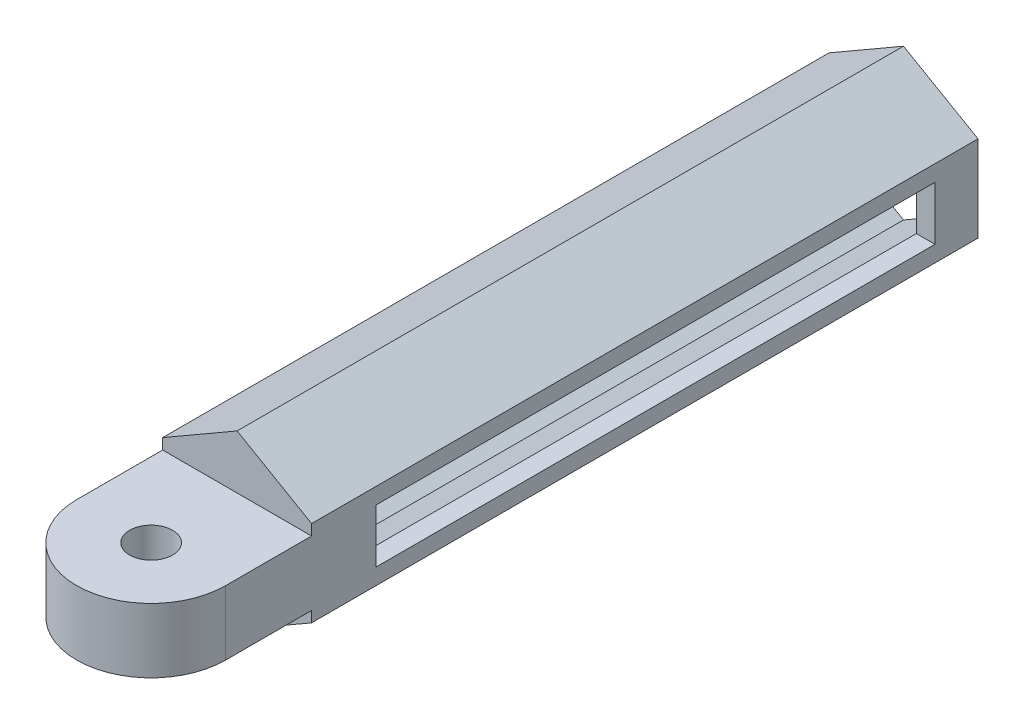
ISO-10303-21;
HEADER;
FILE_DESCRIPTION(('STEP AP214'),'2;1');
FILE_NAME('part.step','',(''),(''),'','','');
FILE_SCHEMA(('AUTOMOTIVE_DESIGN { 1 0 10303 214 1 1 1 1 }'));
ENDSEC;
DATA;
#1=APPLICATION_CONTEXT('core data for automotive mechanical design processes');
#2=APPLICATION_PROTOCOL_DEFINITION('international standard','automotive_design',2000,#1);
#3=PRODUCT_CONTEXT('',#1,'mechanical');
#4=PRODUCT('Part','Part','',(#3));
#5=PRODUCT_RELATED_PRODUCT_CATEGORY('part','',(#4));
#6=PRODUCT_DEFINITION_FORMATION('','',#4);
#7=PRODUCT_DEFINITION_CONTEXT('part definition',#1,'design');
#8=PRODUCT_DEFINITION('design','',#6,#7);
#9=PRODUCT_DEFINITION_SHAPE('','',#8);
#10=(LENGTH_UNIT() NAMED_UNIT(*) SI_UNIT(.MILLI.,.METRE.));
#11=(NAMED_UNIT(*) PLANE_ANGLE_UNIT() SI_UNIT($,.RADIAN.));
#12=(NAMED_UNIT(*) SI_UNIT($,.STERADIAN.) SOLID_ANGLE_UNIT());
#13=UNCERTAINTY_MEASURE_WITH_UNIT(LENGTH_MEASURE(1.E-05),#10,'distance_accuracy_value','');
#14=(GEOMETRIC_REPRESENTATION_CONTEXT(3) GLOBAL_UNCERTAINTY_ASSIGNED_CONTEXT((#13)) GLOBAL_UNIT_ASSIGNED_CONTEXT((#10,
#11,#12)) REPRESENTATION_CONTEXT('',''));
#15=CARTESIAN_POINT('',(0.,0.,0.));
#16=DIRECTION('',(0.,0.,1.));
#17=DIRECTION('',(1.,0.,0.));
#18=AXIS2_PLACEMENT_3D('',#15,#16,#17);
#19=CARTESIAN_POINT('',(0.,0.,31.));
#20=DIRECTION('',(0.,0.,1.));
#21=DIRECTION('',(1.,0.,0.));
#22=AXIS2_PLACEMENT_3D('',#19,#20,#21);
#23=PLANE('',#22);
#24=DIRECTION('',(0.,1.,0.));
#25=VECTOR('',#24,1.);
#26=CARTESIAN_POINT('',(3.46410161513775,-2.,31.));
#27=LINE('',#26,#25);
#28=CARTESIAN_POINT('',(3.46410161513775,-2.,31.));
#29=VERTEX_POINT('',#28);
#30=CARTESIAN_POINT('',(3.46410161513775,-1.5,31.));
#31=VERTEX_POINT('',#30);
#32=EDGE_CURVE('E222',#29,#31,#27,.T.);
#33=ORIENTED_EDGE('',*,*,#32,.T.);
#34=DIRECTION('',(-1.,0.,0.));
#35=VECTOR('',#34,1.);
#36=CARTESIAN_POINT('',(3.46410161513775,-1.5,31.));
#37=LINE('',#36,#35);
#38=CARTESIAN_POINT('',(-3.46410161513775,-1.5,31.));
#39=VERTEX_POINT('',#38);
#40=EDGE_CURVE('E404',#31,#39,#37,.T.);
#41=ORIENTED_EDGE('',*,*,#40,.T.);
#42=DIRECTION('',(0.,-1.,0.));
#43=VECTOR('',#42,1.);
#44=CARTESIAN_POINT('',(-3.46410161513775,2.,31.));
#45=LINE('',#44,#43);
#46=CARTESIAN_POINT('',(-3.46410161513775,-2.,31.));
#47=VERTEX_POINT('',#46);
#48=EDGE_CURVE('E370',#39,#47,#45,.T.);
#49=ORIENTED_EDGE('',*,*,#48,.T.);
#50=DIRECTION('',(0.866025403784439,-0.5,0.));
#51=VECTOR('',#50,1.);
#52=CARTESIAN_POINT('',(-3.46410161513775,-2.,31.));
#53=LINE('',#52,#51);
#54=CARTESIAN_POINT('',(0.,-4.,31.));
#55=VERTEX_POINT('',#54);
#56=EDGE_CURVE('E228',#47,#55,#53,.T.);
#57=ORIENTED_EDGE('',*,*,#56,.T.);
#58=DIRECTION('',(0.866025403784438,0.5,0.));
#59=VECTOR('',#58,1.);
#60=CARTESIAN_POINT('',(0.,-4.,31.));
#61=LINE('',#60,#59);
#62=EDGE_CURVE('E223',#55,#29,#61,.T.);
#63=ORIENTED_EDGE('',*,*,#62,.T.);
#64=EDGE_LOOP('',(#33,#41,#49,#57,#63));
#65=FACE_BOUND('',#64,.T.);
#66=ADVANCED_FACE('F33',(#65),#23,.T.);
#67=CARTESIAN_POINT('',(0.,0.,0.));
#68=DIRECTION('',(0.,0.,1.));
#69=DIRECTION('',(1.,0.,0.));
#70=AXIS2_PLACEMENT_3D('',#67,#68,#69);
#71=PLANE('',#70);
#72=DIRECTION('',(-0.866025403784439,0.5,0.));
#73=VECTOR('',#72,1.);
#74=CARTESIAN_POINT('',(3.46410161513775,2.,0.));
#75=LINE('',#74,#73);
#76=CARTESIAN_POINT('',(3.46410161513775,2.,0.));
#77=VERTEX_POINT('',#76);
#78=CARTESIAN_POINT('',(0.,4.,0.));
#79=VERTEX_POINT('',#78);
#80=EDGE_CURVE('E281',#77,#79,#75,.T.);
#81=ORIENTED_EDGE('',*,*,#80,.F.);
#82=DIRECTION('',(0.,1.,0.));
#83=VECTOR('',#82,1.);
#84=CARTESIAN_POINT('',(3.46410161513776,-2.,0.));
#85=LINE('',#84,#83);
#86=CARTESIAN_POINT('',(3.46410161513776,-2.,0.));
#87=VERTEX_POINT('',#86);
#88=EDGE_CURVE('E292',#87,#77,#85,.T.);
#89=ORIENTED_EDGE('',*,*,#88,.F.);
#90=DIRECTION('',(0.866025403784439,0.5,0.));
#91=VECTOR('',#90,1.);
#92=CARTESIAN_POINT('',(0.,-4.,0.));
#93=LINE('',#92,#91);
#94=CARTESIAN_POINT('',(0.,-4.,0.));
#95=VERTEX_POINT('',#94);
#96=EDGE_CURVE('E290',#95,#87,#93,.T.);
#97=ORIENTED_EDGE('',*,*,#96,.F.);
#98=DIRECTION('',(0.866025403784439,-0.5,0.));
#99=VECTOR('',#98,1.);
#100=CARTESIAN_POINT('',(-3.46410161513775,-2.,0.));
#101=LINE('',#100,#99);
#102=CARTESIAN_POINT('',(-3.46410161513775,-2.,0.));
#103=VERTEX_POINT('',#102);
#104=EDGE_CURVE('E288',#103,#95,#101,.T.);
#105=ORIENTED_EDGE('',*,*,#104,.F.);
#106=DIRECTION('',(0.,-1.,0.));
#107=VECTOR('',#106,1.);
#108=CARTESIAN_POINT('',(-3.46410161513775,2.,0.));
#109=LINE('',#108,#107);
#110=CARTESIAN_POINT('',(-3.46410161513775,2.,0.));
#111=VERTEX_POINT('',#110);
#112=EDGE_CURVE('E286',#111,#103,#109,.T.);
#113=ORIENTED_EDGE('',*,*,#112,.F.);
#114=DIRECTION('',(-0.866025403784439,-0.5,0.));
#115=VECTOR('',#114,1.);
#116=CARTESIAN_POINT('',(0.,4.,0.));
#117=LINE('',#116,#115);
#118=EDGE_CURVE('E284',#79,#111,#117,.T.);
#119=ORIENTED_EDGE('',*,*,#118,.F.);
#120=EDGE_LOOP('',(#81,#89,#97,#105,#113,#119));
#121=FACE_BOUND('',#120,.T.);
#122=DIRECTION('',(-0.866025403784439,0.5,0.));
#123=VECTOR('',#122,1.);
#124=CARTESIAN_POINT('',(2.59807621135332,1.5,0.));
#125=LINE('',#124,#123);
#126=CARTESIAN_POINT('',(2.59807621135332,1.5,0.));
#127=VERTEX_POINT('',#126);
#128=CARTESIAN_POINT('',(0.,3.,0.));
#129=VERTEX_POINT('',#128);
#130=EDGE_CURVE('E226',#127,#129,#125,.T.);
#131=ORIENTED_EDGE('',*,*,#130,.T.);
#132=DIRECTION('',(-0.866025403784439,-0.5,0.));
#133=VECTOR('',#132,1.);
#134=CARTESIAN_POINT('',(0.,3.,0.));
#135=LINE('',#134,#133);
#136=CARTESIAN_POINT('',(-2.59807621135332,1.5,0.));
#137=VERTEX_POINT('',#136);
#138=EDGE_CURVE('E254',#129,#137,#135,.T.);
#139=ORIENTED_EDGE('',*,*,#138,.T.);
#140=DIRECTION('',(0.,-1.,0.));
#141=VECTOR('',#140,1.);
#142=CARTESIAN_POINT('',(-2.59807621135332,1.5,0.));
#143=LINE('',#142,#141);
#144=CARTESIAN_POINT('',(-2.59807621135332,-1.5,0.));
#145=VERTEX_POINT('',#144);
#146=EDGE_CURVE('E257',#137,#145,#143,.T.);
#147=ORIENTED_EDGE('',*,*,#146,.T.);
#148=DIRECTION('',(0.866025403784439,-0.5,0.));
#149=VECTOR('',#148,1.);
#150=CARTESIAN_POINT('',(-2.59807621135332,-1.5,0.));
#151=LINE('',#150,#149);
#152=CARTESIAN_POINT('',(0.,-3.,0.));
#153=VERTEX_POINT('',#152);
#154=EDGE_CURVE('E260',#145,#153,#151,.T.);
#155=ORIENTED_EDGE('',*,*,#154,.T.);
#156=DIRECTION('',(0.866025403784439,0.5,0.));
#157=VECTOR('',#156,1.);
#158=CARTESIAN_POINT('',(0.,-3.,0.));
#159=LINE('',#158,#157);
#160=CARTESIAN_POINT('',(2.59807621135332,-1.5,0.));
#161=VERTEX_POINT('',#160);
#162=EDGE_CURVE('E263',#153,#161,#159,.T.);
#163=ORIENTED_EDGE('',*,*,#162,.T.);
#164=DIRECTION('',(0.,1.,0.));
#165=VECTOR('',#164,1.);
#166=CARTESIAN_POINT('',(2.59807621135332,-1.5,0.));
#167=LINE('',#166,#165);
#168=EDGE_CURVE('E236',#161,#127,#167,.T.);
#169=ORIENTED_EDGE('',*,*,#168,.T.);
#170=EDGE_LOOP('',(#131,#139,#147,#155,#163,#169));
#171=FACE_BOUND('',#170,.T.);
#172=ADVANCED_FACE('F386',(#121,#171),#71,.F.);
#173=CARTESIAN_POINT('',(3.46410161513775,2.,30.));
#174=DIRECTION('',(-0.5,-0.866025403784439,0.));
#175=DIRECTION('',(0.866025403784439,-0.5,0.));
#176=AXIS2_PLACEMENT_3D('',#173,#174,#175);
#177=PLANE('',#176);
#178=ORIENTED_EDGE('',*,*,#80,.T.);
#179=DIRECTION('',(0.,0.,-1.));
#180=VECTOR('',#179,1.);
#181=CARTESIAN_POINT('',(0.,4.,30.));
#182=LINE('',#181,#180);
#183=CARTESIAN_POINT('',(0.,4.,31.));
#184=VERTEX_POINT('',#183);
#185=EDGE_CURVE('E307',#184,#79,#182,.T.);
#186=ORIENTED_EDGE('',*,*,#185,.F.);
#187=DIRECTION('',(-0.866025403784439,0.5,0.));
#188=VECTOR('',#187,1.);
#189=CARTESIAN_POINT('',(3.46410161513775,2.,31.));
#190=LINE('',#189,#188);
#191=CARTESIAN_POINT('',(3.46410161513775,2.,31.));
#192=VERTEX_POINT('',#191);
#193=EDGE_CURVE('E366',#192,#184,#190,.T.);
#194=ORIENTED_EDGE('',*,*,#193,.F.);
#195=DIRECTION('',(0.,0.,-1.));
#196=VECTOR('',#195,1.);
#197=CARTESIAN_POINT('',(3.46410161513775,2.,30.));
#198=LINE('',#197,#196);
#199=EDGE_CURVE('E220',#192,#77,#198,.T.);
#200=ORIENTED_EDGE('',*,*,#199,.T.);
#201=EDGE_LOOP('',(#178,#186,#194,#200));
#202=FACE_BOUND('',#201,.T.);
#203=ADVANCED_FACE('F35',(#202),#177,.F.);
#204=CARTESIAN_POINT('',(0.,4.,30.));
#205=DIRECTION('',(0.5,-0.866025403784439,0.));
#206=DIRECTION('',(0.866025403784439,0.5,0.));
#207=AXIS2_PLACEMENT_3D('',#204,#205,#206);
#208=PLANE('',#207);
#209=ORIENTED_EDGE('',*,*,#118,.T.);
#210=DIRECTION('',(0.,0.,-1.));
#211=VECTOR('',#210,1.);
#212=CARTESIAN_POINT('',(-3.46410161513775,2.,30.));
#213=LINE('',#212,#211);
#214=CARTESIAN_POINT('',(-3.46410161513775,2.,31.));
#215=VERTEX_POINT('',#214);
#216=EDGE_CURVE('E304',#215,#111,#213,.T.);
#217=ORIENTED_EDGE('',*,*,#216,.F.);
#218=DIRECTION('',(-0.866025403784439,-0.5,0.));
#219=VECTOR('',#218,1.);
#220=CARTESIAN_POINT('',(0.,4.,31.));
#221=LINE('',#220,#219);
#222=EDGE_CURVE('E368',#184,#215,#221,.T.);
#223=ORIENTED_EDGE('',*,*,#222,.F.);
#224=ORIENTED_EDGE('',*,*,#185,.T.);
#225=EDGE_LOOP('',(#209,#217,#223,#224));
#226=FACE_BOUND('',#225,.T.);
#227=ADVANCED_FACE('F586',(#226),#208,.F.);
#228=CARTESIAN_POINT('',(-3.46410161513775,2.,30.));
#229=DIRECTION('',(1.,0.,0.));
#230=DIRECTION('',(0.,0.,-1.));
#231=AXIS2_PLACEMENT_3D('',#228,#229,#230);
#232=PLANE('',#231);
#233=DIRECTION('',(0.,0.,-1.));
#234=VECTOR('',#233,1.);
#235=CARTESIAN_POINT('',(-3.46410161513775,1.25,28.));
#236=LINE('',#235,#234);
#237=CARTESIAN_POINT('',(-3.46410161513775,1.25,28.));
#238=VERTEX_POINT('',#237);
#239=CARTESIAN_POINT('',(-3.46410161513775,1.25,2.));
#240=VERTEX_POINT('',#239);
#241=EDGE_CURVE('E415',#238,#240,#236,.T.);
#242=ORIENTED_EDGE('',*,*,#241,.F.);
#243=DIRECTION('',(0.,1.,0.));
#244=VECTOR('',#243,1.);
#245=CARTESIAN_POINT('',(-3.46410161513775,1.25,28.));
#246=LINE('',#245,#244);
#247=CARTESIAN_POINT('',(-3.46410161513775,-1.25,28.));
#248=VERTEX_POINT('',#247);
#249=EDGE_CURVE('E357',#248,#238,#246,.T.);
#250=ORIENTED_EDGE('',*,*,#249,.F.);
#251=DIRECTION('',(0.,0.,1.));
#252=VECTOR('',#251,1.);
#253=CARTESIAN_POINT('',(-3.46410161513775,-1.25,28.));
#254=LINE('',#253,#252);
#255=CARTESIAN_POINT('',(-3.46410161513775,-1.25,2.));
#256=VERTEX_POINT('',#255);
#257=EDGE_CURVE('E354',#256,#248,#254,.T.);
#258=ORIENTED_EDGE('',*,*,#257,.F.);
#259=DIRECTION('',(0.,-1.,0.));
#260=VECTOR('',#259,1.);
#261=CARTESIAN_POINT('',(-3.46410161513775,1.25,2.));
#262=LINE('',#261,#260);
#263=EDGE_CURVE('E413',#240,#256,#262,.T.);
#264=ORIENTED_EDGE('',*,*,#263,.F.);
#265=EDGE_LOOP('',(#242,#250,#258,#264));
#266=FACE_BOUND('',#265,.T.);
#267=ORIENTED_EDGE('',*,*,#112,.T.);
#268=DIRECTION('',(0.,0.,-1.));
#269=VECTOR('',#268,1.);
#270=CARTESIAN_POINT('',(-3.46410161513775,-2.,30.));
#271=LINE('',#270,#269);
#272=EDGE_CURVE('E301',#47,#103,#271,.T.);
#273=ORIENTED_EDGE('',*,*,#272,.F.);
#274=ORIENTED_EDGE('',*,*,#48,.F.);
#275=DIRECTION('',(0.,0.,1.));
#276=VECTOR('',#275,1.);
#277=CARTESIAN_POINT('',(-3.46410161513775,-1.5,31.));
#278=LINE('',#277,#276);
#279=CARTESIAN_POINT('',(-3.46410161513775,-1.5,35.));
#280=VERTEX_POINT('',#279);
#281=EDGE_CURVE('E48',#39,#280,#278,.T.);
#282=ORIENTED_EDGE('',*,*,#281,.T.);
#283=DIRECTION('',(0.,1.,0.));
#284=VECTOR('',#283,1.);
#285=CARTESIAN_POINT('',(-3.46410161513775,-1.5,35.));
#286=LINE('',#285,#284);
#287=CARTESIAN_POINT('',(-3.46410161513775,1.5,35.));
#288=VERTEX_POINT('',#287);
#289=EDGE_CURVE('E395',#280,#288,#286,.T.);
#290=ORIENTED_EDGE('',*,*,#289,.T.);
#291=DIRECTION('',(0.,0.,1.));
#292=VECTOR('',#291,1.);
#293=CARTESIAN_POINT('',(-3.46410161513775,1.5,31.));
#294=LINE('',#293,#292);
#295=CARTESIAN_POINT('',(-3.46410161513775,1.5,31.));
#296=VERTEX_POINT('',#295);
#297=EDGE_CURVE('E216',#296,#288,#294,.T.);
#298=ORIENTED_EDGE('',*,*,#297,.F.);
#299=EDGE_CURVE('E215',#215,#296,#45,.T.);
#300=ORIENTED_EDGE('',*,*,#299,.F.);
#301=ORIENTED_EDGE('',*,*,#216,.T.);
#302=EDGE_LOOP('',(#267,#273,#274,#282,#290,#298,#300,#301));
#303=FACE_BOUND('',#302,.T.);
#304=ADVANCED_FACE('F394',(#266,#303),#232,.F.);
#305=CARTESIAN_POINT('',(-3.46410161513775,-2.,30.));
#306=DIRECTION('',(0.5,0.866025403784439,0.));
#307=DIRECTION('',(-0.866025403784439,0.5,0.));
#308=AXIS2_PLACEMENT_3D('',#305,#306,#307);
#309=PLANE('',#308);
#310=ORIENTED_EDGE('',*,*,#104,.T.);
#311=DIRECTION('',(0.,0.,-1.));
#312=VECTOR('',#311,1.);
#313=CARTESIAN_POINT('',(0.,-4.,30.));
#314=LINE('',#313,#312);
#315=EDGE_CURVE('E298',#55,#95,#314,.T.);
#316=ORIENTED_EDGE('',*,*,#315,.F.);
#317=ORIENTED_EDGE('',*,*,#56,.F.);
#318=ORIENTED_EDGE('',*,*,#272,.T.);
#319=EDGE_LOOP('',(#310,#316,#317,#318));
#320=FACE_BOUND('',#319,.T.);
#321=ADVANCED_FACE('F439',(#320),#309,.F.);
#322=CARTESIAN_POINT('',(0.,-4.,30.));
#323=DIRECTION('',(-0.5,0.866025403784439,0.));
#324=DIRECTION('',(-0.866025403784439,-0.5,0.));
#325=AXIS2_PLACEMENT_3D('',#322,#323,#324);
#326=PLANE('',#325);
#327=ORIENTED_EDGE('',*,*,#96,.T.);
#328=DIRECTION('',(0.,0.,-1.));
#329=VECTOR('',#328,1.);
#330=CARTESIAN_POINT('',(3.46410161513776,-2.,30.));
#331=LINE('',#330,#329);
#332=EDGE_CURVE('E295',#29,#87,#331,.T.);
#333=ORIENTED_EDGE('',*,*,#332,.F.);
#334=ORIENTED_EDGE('',*,*,#62,.F.);
#335=ORIENTED_EDGE('',*,*,#315,.T.);
#336=EDGE_LOOP('',(#327,#333,#334,#335));
#337=FACE_BOUND('',#336,.T.);
#338=ADVANCED_FACE('F380',(#337),#326,.F.);
#339=CARTESIAN_POINT('',(3.46410161513776,-2.,30.));
#340=DIRECTION('',(-1.,0.,0.));
#341=DIRECTION('',(0.,-1.,0.));
#342=AXIS2_PLACEMENT_3D('',#339,#340,#341);
#343=PLANE('',#342);
#344=DIRECTION('',(0.,0.,-1.));
#345=VECTOR('',#344,1.);
#346=CARTESIAN_POINT('',(3.46410161513775,-1.25,28.));
#347=LINE('',#346,#345);
#348=CARTESIAN_POINT('',(3.46410161513775,-1.25,28.));
#349=VERTEX_POINT('',#348);
#350=CARTESIAN_POINT('',(3.46410161513775,-1.25,2.));
#351=VERTEX_POINT('',#350);
#352=EDGE_CURVE('E420',#349,#351,#347,.T.);
#353=ORIENTED_EDGE('',*,*,#352,.F.);
#354=DIRECTION('',(0.,-1.,0.));
#355=VECTOR('',#354,1.);
#356=CARTESIAN_POINT('',(3.46410161513775,1.25,28.));
#357=LINE('',#356,#355);
#358=CARTESIAN_POINT('',(3.46410161513775,1.25,28.));
#359=VERTEX_POINT('',#358);
#360=EDGE_CURVE('E347',#359,#349,#357,.T.);
#361=ORIENTED_EDGE('',*,*,#360,.F.);
#362=DIRECTION('',(0.,0.,1.));
#363=VECTOR('',#362,1.);
#364=CARTESIAN_POINT('',(3.46410161513775,1.25,28.));
#365=LINE('',#364,#363);
#366=CARTESIAN_POINT('',(3.46410161513775,1.25,2.));
#367=VERTEX_POINT('',#366);
#368=EDGE_CURVE('E349',#367,#359,#365,.T.);
#369=ORIENTED_EDGE('',*,*,#368,.F.);
#370=DIRECTION('',(0.,1.,0.));
#371=VECTOR('',#370,1.);
#372=CARTESIAN_POINT('',(3.46410161513775,1.25,2.));
#373=LINE('',#372,#371);
#374=EDGE_CURVE('E330',#351,#367,#373,.T.);
#375=ORIENTED_EDGE('',*,*,#374,.F.);
#376=EDGE_LOOP('',(#353,#361,#369,#375));
#377=FACE_BOUND('',#376,.T.);
#378=ORIENTED_EDGE('',*,*,#88,.T.);
#379=ORIENTED_EDGE('',*,*,#199,.F.);
#380=CARTESIAN_POINT('',(3.46410161513775,1.5,31.));
#381=VERTEX_POINT('',#380);
#382=EDGE_CURVE('E211',#381,#192,#27,.T.);
#383=ORIENTED_EDGE('',*,*,#382,.F.);
#384=DIRECTION('',(0.,0.,-1.));
#385=VECTOR('',#384,1.);
#386=CARTESIAN_POINT('',(3.46410161513775,1.5,31.));
#387=LINE('',#386,#385);
#388=CARTESIAN_POINT('',(3.46410161513775,1.5,35.));
#389=VERTEX_POINT('',#388);
#390=EDGE_CURVE('E194',#389,#381,#387,.T.);
#391=ORIENTED_EDGE('',*,*,#390,.F.);
#392=DIRECTION('',(0.,1.,0.));
#393=VECTOR('',#392,1.);
#394=CARTESIAN_POINT('',(3.46410161513775,-1.5,35.));
#395=LINE('',#394,#393);
#396=CARTESIAN_POINT('',(3.46410161513775,-1.5,35.));
#397=VERTEX_POINT('',#396);
#398=EDGE_CURVE('E410',#397,#389,#395,.T.);
#399=ORIENTED_EDGE('',*,*,#398,.F.);
#400=DIRECTION('',(0.,0.,-1.));
#401=VECTOR('',#400,1.);
#402=CARTESIAN_POINT('',(3.46410161513775,-1.5,31.));
#403=LINE('',#402,#401);
#404=EDGE_CURVE('E402',#397,#31,#403,.T.);
#405=ORIENTED_EDGE('',*,*,#404,.T.);
#406=ORIENTED_EDGE('',*,*,#32,.F.);
#407=ORIENTED_EDGE('',*,*,#332,.T.);
#408=EDGE_LOOP('',(#378,#379,#383,#391,#399,#405,#406,#407));
#409=FACE_BOUND('',#408,.T.);
#410=ADVANCED_FACE('F218',(#377,#409),#343,.F.);
#411=CARTESIAN_POINT('',(2.59807621135332,1.5,30.));
#412=DIRECTION('',(-0.5,-0.866025403784439,0.));
#413=DIRECTION('',(0.866025403784439,-0.5,0.));
#414=AXIS2_PLACEMENT_3D('',#411,#412,#413);
#415=PLANE('',#414);
#416=ORIENTED_EDGE('',*,*,#130,.F.);
#417=DIRECTION('',(0.,0.,-1.));
#418=VECTOR('',#417,1.);
#419=CARTESIAN_POINT('',(2.59807621135332,1.5,30.));
#420=LINE('',#419,#418);
#421=CARTESIAN_POINT('',(2.59807621135332,1.5,30.));
#422=VERTEX_POINT('',#421);
#423=EDGE_CURVE('E251',#422,#127,#420,.T.);
#424=ORIENTED_EDGE('',*,*,#423,.F.);
#425=DIRECTION('',(-0.866025403784439,0.5,0.));
#426=VECTOR('',#425,1.);
#427=CARTESIAN_POINT('',(2.59807621135332,1.5,30.));
#428=LINE('',#427,#426);
#429=CARTESIAN_POINT('',(0.,3.,30.));
#430=VERTEX_POINT('',#429);
#431=EDGE_CURVE('E232',#422,#430,#428,.T.);
#432=ORIENTED_EDGE('',*,*,#431,.T.);
#433=DIRECTION('',(0.,0.,-1.));
#434=VECTOR('',#433,1.);
#435=CARTESIAN_POINT('',(0.,3.,30.));
#436=LINE('',#435,#434);
#437=EDGE_CURVE('E278',#430,#129,#436,.T.);
#438=ORIENTED_EDGE('',*,*,#437,.T.);
#439=EDGE_LOOP('',(#416,#424,#432,#438));
#440=FACE_BOUND('',#439,.T.);
#441=ADVANCED_FACE('F430',(#440),#415,.T.);
#442=CARTESIAN_POINT('',(0.,3.,30.));
#443=DIRECTION('',(0.5,-0.866025403784439,0.));
#444=DIRECTION('',(0.866025403784439,0.5,0.));
#445=AXIS2_PLACEMENT_3D('',#442,#443,#444);
#446=PLANE('',#445);
#447=ORIENTED_EDGE('',*,*,#138,.F.);
#448=ORIENTED_EDGE('',*,*,#437,.F.);
#449=DIRECTION('',(-0.866025403784439,-0.5,0.));
#450=VECTOR('',#449,1.);
#451=CARTESIAN_POINT('',(0.,3.,30.));
#452=LINE('',#451,#450);
#453=CARTESIAN_POINT('',(-2.59807621135332,1.5,30.));
#454=VERTEX_POINT('',#453);
#455=EDGE_CURVE('E235',#430,#454,#452,.T.);
#456=ORIENTED_EDGE('',*,*,#455,.T.);
#457=DIRECTION('',(0.,0.,-1.));
#458=VECTOR('',#457,1.);
#459=CARTESIAN_POINT('',(-2.59807621135332,1.5,30.));
#460=LINE('',#459,#458);
#461=EDGE_CURVE('E276',#454,#137,#460,.T.);
#462=ORIENTED_EDGE('',*,*,#461,.T.);
#463=EDGE_LOOP('',(#447,#448,#456,#462));
#464=FACE_BOUND('',#463,.T.);
#465=ADVANCED_FACE('F436',(#464),#446,.T.);
#466=CARTESIAN_POINT('',(-2.59807621135332,1.5,30.));
#467=DIRECTION('',(1.,0.,0.));
#468=DIRECTION('',(0.,0.,-1.));
#469=AXIS2_PLACEMENT_3D('',#466,#467,#468);
#470=PLANE('',#469);
#471=DIRECTION('',(0.,-1.,0.));
#472=VECTOR('',#471,1.);
#473=CARTESIAN_POINT('',(-2.59807621135332,1.5,28.));
#474=LINE('',#473,#472);
#475=CARTESIAN_POINT('',(-2.59807621135331,1.25,28.));
#476=VERTEX_POINT('',#475);
#477=CARTESIAN_POINT('',(-2.59807621135332,-1.25,28.));
#478=VERTEX_POINT('',#477);
#479=EDGE_CURVE('E363',#476,#478,#474,.T.);
#480=ORIENTED_EDGE('',*,*,#479,.F.);
#481=DIRECTION('',(0.,0.,1.));
#482=VECTOR('',#481,1.);
#483=CARTESIAN_POINT('',(-2.59807621135332,1.25,30.));
#484=LINE('',#483,#482);
#485=CARTESIAN_POINT('',(-2.59807621135331,1.25,2.));
#486=VERTEX_POINT('',#485);
#487=EDGE_CURVE('E361',#486,#476,#484,.T.);
#488=ORIENTED_EDGE('',*,*,#487,.F.);
#489=DIRECTION('',(0.,1.,0.));
#490=VECTOR('',#489,1.);
#491=CARTESIAN_POINT('',(-2.59807621135332,1.5,2.));
#492=LINE('',#491,#490);
#493=CARTESIAN_POINT('',(-2.59807621135331,-1.25,2.));
#494=VERTEX_POINT('',#493);
#495=EDGE_CURVE('E359',#494,#486,#492,.T.);
#496=ORIENTED_EDGE('',*,*,#495,.F.);
#497=DIRECTION('',(0.,0.,-1.));
#498=VECTOR('',#497,1.);
#499=CARTESIAN_POINT('',(-2.59807621135332,-1.25,30.));
#500=LINE('',#499,#498);
#501=EDGE_CURVE('E356',#478,#494,#500,.T.);
#502=ORIENTED_EDGE('',*,*,#501,.F.);
#503=EDGE_LOOP('',(#480,#488,#496,#502));
#504=FACE_BOUND('',#503,.T.);
#505=ORIENTED_EDGE('',*,*,#146,.F.);
#506=ORIENTED_EDGE('',*,*,#461,.F.);
#507=DIRECTION('',(0.,-1.,0.));
#508=VECTOR('',#507,1.);
#509=CARTESIAN_POINT('',(-2.59807621135332,1.5,30.));
#510=LINE('',#509,#508);
#511=CARTESIAN_POINT('',(-2.59807621135332,-1.5,30.));
#512=VERTEX_POINT('',#511);
#513=EDGE_CURVE('E239',#454,#512,#510,.T.);
#514=ORIENTED_EDGE('',*,*,#513,.T.);
#515=DIRECTION('',(0.,0.,-1.));
#516=VECTOR('',#515,1.);
#517=CARTESIAN_POINT('',(-2.59807621135332,-1.5,30.));
#518=LINE('',#517,#516);
#519=EDGE_CURVE('E274',#512,#145,#518,.T.);
#520=ORIENTED_EDGE('',*,*,#519,.T.);
#521=EDGE_LOOP('',(#505,#506,#514,#520));
#522=FACE_BOUND('',#521,.T.);
#523=ADVANCED_FACE('F470',(#504,#522),#470,.T.);
#524=CARTESIAN_POINT('',(-2.59807621135332,-1.5,30.));
#525=DIRECTION('',(0.5,0.866025403784439,0.));
#526=DIRECTION('',(-0.866025403784439,0.5,0.));
#527=AXIS2_PLACEMENT_3D('',#524,#525,#526);
#528=PLANE('',#527);
#529=ORIENTED_EDGE('',*,*,#154,.F.);
#530=ORIENTED_EDGE('',*,*,#519,.F.);
#531=DIRECTION('',(0.866025403784439,-0.5,0.));
#532=VECTOR('',#531,1.);
#533=CARTESIAN_POINT('',(-2.59807621135332,-1.5,30.));
#534=LINE('',#533,#532);
#535=CARTESIAN_POINT('',(0.,-3.,30.));
#536=VERTEX_POINT('',#535);
#537=EDGE_CURVE('E242',#512,#536,#534,.T.);
#538=ORIENTED_EDGE('',*,*,#537,.T.);
#539=DIRECTION('',(0.,0.,-1.));
#540=VECTOR('',#539,1.);
#541=CARTESIAN_POINT('',(0.,-3.,30.));
#542=LINE('',#541,#540);
#543=EDGE_CURVE('E272',#536,#153,#542,.T.);
#544=ORIENTED_EDGE('',*,*,#543,.T.);
#545=EDGE_LOOP('',(#529,#530,#538,#544));
#546=FACE_BOUND('',#545,.T.);
#547=ADVANCED_FACE('F466',(#546),#528,.T.);
#548=CARTESIAN_POINT('',(0.,-3.,30.));
#549=DIRECTION('',(-0.5,0.866025403784439,0.));
#550=DIRECTION('',(-0.866025403784439,-0.5,0.));
#551=AXIS2_PLACEMENT_3D('',#548,#549,#550);
#552=PLANE('',#551);
#553=ORIENTED_EDGE('',*,*,#162,.F.);
#554=ORIENTED_EDGE('',*,*,#543,.F.);
#555=DIRECTION('',(0.866025403784439,0.5,0.));
#556=VECTOR('',#555,1.);
#557=CARTESIAN_POINT('',(0.,-3.,30.));
#558=LINE('',#557,#556);
#559=CARTESIAN_POINT('',(2.59807621135332,-1.5,30.));
#560=VERTEX_POINT('',#559);
#561=EDGE_CURVE('E245',#536,#560,#558,.T.);
#562=ORIENTED_EDGE('',*,*,#561,.T.);
#563=DIRECTION('',(0.,0.,-1.));
#564=VECTOR('',#563,1.);
#565=CARTESIAN_POINT('',(2.59807621135332,-1.5,30.));
#566=LINE('',#565,#564);
#567=EDGE_CURVE('E270',#560,#161,#566,.T.);
#568=ORIENTED_EDGE('',*,*,#567,.T.);
#569=EDGE_LOOP('',(#553,#554,#562,#568));
#570=FACE_BOUND('',#569,.T.);
#571=ADVANCED_FACE('F461',(#570),#552,.T.);
#572=CARTESIAN_POINT('',(2.59807621135332,-1.5,30.));
#573=DIRECTION('',(-1.,0.,0.));
#574=DIRECTION('',(0.,-1.,0.));
#575=AXIS2_PLACEMENT_3D('',#572,#573,#574);
#576=PLANE('',#575);
#577=DIRECTION('',(0.,1.,0.));
#578=VECTOR('',#577,1.);
#579=CARTESIAN_POINT('',(2.59807621135332,-1.5,28.));
#580=LINE('',#579,#578);
#581=CARTESIAN_POINT('',(2.59807621135332,-1.25,28.));
#582=VERTEX_POINT('',#581);
#583=CARTESIAN_POINT('',(2.59807621135332,1.25,28.));
#584=VERTEX_POINT('',#583);
#585=EDGE_CURVE('E11',#582,#584,#580,.T.);
#586=ORIENTED_EDGE('',*,*,#585,.F.);
#587=DIRECTION('',(0.,0.,1.));
#588=VECTOR('',#587,1.);
#589=CARTESIAN_POINT('',(2.59807621135332,-1.25,30.));
#590=LINE('',#589,#588);
#591=CARTESIAN_POINT('',(2.59807621135332,-1.25,2.));
#592=VERTEX_POINT('',#591);
#593=EDGE_CURVE('E310',#592,#582,#590,.T.);
#594=ORIENTED_EDGE('',*,*,#593,.F.);
#595=DIRECTION('',(0.,-1.,0.));
#596=VECTOR('',#595,1.);
#597=CARTESIAN_POINT('',(2.59807621135332,-1.5,2.));
#598=LINE('',#597,#596);
#599=CARTESIAN_POINT('',(2.59807621135332,1.25,2.));
#600=VERTEX_POINT('',#599);
#601=EDGE_CURVE('E312',#600,#592,#598,.T.);
#602=ORIENTED_EDGE('',*,*,#601,.F.);
#603=DIRECTION('',(0.,0.,-1.));
#604=VECTOR('',#603,1.);
#605=CARTESIAN_POINT('',(2.59807621135332,1.25,30.));
#606=LINE('',#605,#604);
#607=EDGE_CURVE('E41',#584,#600,#606,.T.);
#608=ORIENTED_EDGE('',*,*,#607,.F.);
#609=EDGE_LOOP('',(#586,#594,#602,#608));
#610=FACE_BOUND('',#609,.T.);
#611=ORIENTED_EDGE('',*,*,#168,.F.);
#612=ORIENTED_EDGE('',*,*,#567,.F.);
#613=DIRECTION('',(0.,1.,0.));
#614=VECTOR('',#613,1.);
#615=CARTESIAN_POINT('',(2.59807621135332,-1.5,30.));
#616=LINE('',#615,#614);
#617=EDGE_CURVE('E248',#560,#422,#616,.T.);
#618=ORIENTED_EDGE('',*,*,#617,.T.);
#619=ORIENTED_EDGE('',*,*,#423,.T.);
#620=EDGE_LOOP('',(#611,#612,#618,#619));
#621=FACE_BOUND('',#620,.T.);
#622=ADVANCED_FACE('F334',(#610,#621),#576,.T.);
#623=CARTESIAN_POINT('',(0.,0.,30.));
#624=DIRECTION('',(0.,0.,1.));
#625=DIRECTION('',(1.,0.,0.));
#626=AXIS2_PLACEMENT_3D('',#623,#624,#625);
#627=PLANE('',#626);
#628=ORIENTED_EDGE('',*,*,#431,.F.);
#629=ORIENTED_EDGE('',*,*,#617,.F.);
#630=ORIENTED_EDGE('',*,*,#561,.F.);
#631=ORIENTED_EDGE('',*,*,#537,.F.);
#632=ORIENTED_EDGE('',*,*,#513,.F.);
#633=ORIENTED_EDGE('',*,*,#455,.F.);
#634=EDGE_LOOP('',(#628,#629,#630,#631,#632,#633));
#635=FACE_BOUND('',#634,.T.);
#636=ADVANCED_FACE('F450',(#635),#627,.F.);
#637=DIRECTION('',(-1.,0.,0.));
#638=VECTOR('',#637,1.);
#639=CARTESIAN_POINT('',(3.46410161513775,1.5,31.));
#640=LINE('',#639,#638);
#641=EDGE_CURVE('E199',#381,#296,#640,.T.);
#642=ORIENTED_EDGE('',*,*,#641,.F.);
#643=ORIENTED_EDGE('',*,*,#382,.T.);
#644=ORIENTED_EDGE('',*,*,#193,.T.);
#645=ORIENTED_EDGE('',*,*,#222,.T.);
#646=ORIENTED_EDGE('',*,*,#299,.T.);
#647=EDGE_LOOP('',(#642,#643,#644,#645,#646));
#648=FACE_BOUND('',#647,.T.);
#649=ADVANCED_FACE('F209',(#648),#23,.T.);
#650=CARTESIAN_POINT('',(-29.5840173883557,-1.25,28.));
#651=DIRECTION('',(0.,-1.,0.));
#652=DIRECTION('',(1.,0.,0.));
#653=AXIS2_PLACEMENT_3D('',#650,#651,#652);
#654=PLANE('',#653);
#655=ORIENTED_EDGE('',*,*,#593,.T.);
#656=DIRECTION('',(1.,0.,0.));
#657=VECTOR('',#656,1.);
#658=CARTESIAN_POINT('',(-29.5840173883557,-1.25,28.));
#659=LINE('',#658,#657);
#660=EDGE_CURVE('E341',#582,#349,#659,.T.);
#661=ORIENTED_EDGE('',*,*,#660,.T.);
#662=ORIENTED_EDGE('',*,*,#352,.T.);
#663=DIRECTION('',(1.,0.,0.));
#664=VECTOR('',#663,1.);
#665=CARTESIAN_POINT('',(-29.5840173883557,-1.25,2.));
#666=LINE('',#665,#664);
#667=EDGE_CURVE('E343',#592,#351,#666,.T.);
#668=ORIENTED_EDGE('',*,*,#667,.F.);
#669=EDGE_LOOP('',(#655,#661,#662,#668));
#670=FACE_BOUND('',#669,.T.);
#671=ADVANCED_FACE('F339',(#670),#654,.F.);
#672=CARTESIAN_POINT('',(-29.5840173883557,1.25,2.));
#673=DIRECTION('',(0.,0.,-1.));
#674=DIRECTION('',(-1.,0.,0.));
#675=AXIS2_PLACEMENT_3D('',#672,#673,#674);
#676=PLANE('',#675);
#677=ORIENTED_EDGE('',*,*,#601,.T.);
#678=ORIENTED_EDGE('',*,*,#667,.T.);
#679=ORIENTED_EDGE('',*,*,#374,.T.);
#680=DIRECTION('',(1.,0.,0.));
#681=VECTOR('',#680,1.);
#682=CARTESIAN_POINT('',(-29.5840173883557,1.25,2.));
#683=LINE('',#682,#681);
#684=EDGE_CURVE('E320',#600,#367,#683,.T.);
#685=ORIENTED_EDGE('',*,*,#684,.F.);
#686=EDGE_LOOP('',(#677,#678,#679,#685));
#687=FACE_BOUND('',#686,.T.);
#688=ADVANCED_FACE('F327',(#687),#676,.F.);
#689=CARTESIAN_POINT('',(-29.5840173883557,1.25,28.));
#690=DIRECTION('',(0.,1.,0.));
#691=DIRECTION('',(-1.,0.,0.));
#692=AXIS2_PLACEMENT_3D('',#689,#690,#691);
#693=PLANE('',#692);
#694=ORIENTED_EDGE('',*,*,#607,.T.);
#695=ORIENTED_EDGE('',*,*,#684,.T.);
#696=ORIENTED_EDGE('',*,*,#368,.T.);
#697=DIRECTION('',(1.,0.,0.));
#698=VECTOR('',#697,1.);
#699=CARTESIAN_POINT('',(-29.5840173883557,1.25,28.));
#700=LINE('',#699,#698);
#701=EDGE_CURVE('E322',#584,#359,#700,.T.);
#702=ORIENTED_EDGE('',*,*,#701,.F.);
#703=EDGE_LOOP('',(#694,#695,#696,#702));
#704=FACE_BOUND('',#703,.T.);
#705=ADVANCED_FACE('F318',(#704),#693,.F.);
#706=CARTESIAN_POINT('',(-29.5840173883557,1.25,28.));
#707=DIRECTION('',(0.,0.,1.));
#708=DIRECTION('',(1.,0.,0.));
#709=AXIS2_PLACEMENT_3D('',#706,#707,#708);
#710=PLANE('',#709);
#711=ORIENTED_EDGE('',*,*,#585,.T.);
#712=ORIENTED_EDGE('',*,*,#701,.T.);
#713=ORIENTED_EDGE('',*,*,#360,.T.);
#714=ORIENTED_EDGE('',*,*,#660,.F.);
#715=EDGE_LOOP('',(#711,#712,#713,#714));
#716=FACE_BOUND('',#715,.T.);
#717=ADVANCED_FACE('F345',(#716),#710,.F.);
#718=ORIENTED_EDGE('',*,*,#479,.T.);
#719=EDGE_CURVE('E348',#248,#478,#659,.T.);
#720=ORIENTED_EDGE('',*,*,#719,.F.);
#721=ORIENTED_EDGE('',*,*,#249,.T.);
#722=EDGE_CURVE('E416',#238,#476,#700,.T.);
#723=ORIENTED_EDGE('',*,*,#722,.T.);
#724=EDGE_LOOP('',(#718,#720,#721,#723));
#725=FACE_BOUND('',#724,.T.);
#726=ADVANCED_FACE('F543',(#725),#710,.F.);
#727=ORIENTED_EDGE('',*,*,#487,.T.);
#728=ORIENTED_EDGE('',*,*,#722,.F.);
#729=ORIENTED_EDGE('',*,*,#241,.T.);
#730=EDGE_CURVE('E332',#240,#486,#683,.T.);
#731=ORIENTED_EDGE('',*,*,#730,.T.);
#732=EDGE_LOOP('',(#727,#728,#729,#731));
#733=FACE_BOUND('',#732,.T.);
#734=ADVANCED_FACE('F535',(#733),#693,.F.);
#735=ORIENTED_EDGE('',*,*,#495,.T.);
#736=ORIENTED_EDGE('',*,*,#730,.F.);
#737=ORIENTED_EDGE('',*,*,#263,.T.);
#738=EDGE_CURVE('E56',#256,#494,#666,.T.);
#739=ORIENTED_EDGE('',*,*,#738,.T.);
#740=EDGE_LOOP('',(#735,#736,#737,#739));
#741=FACE_BOUND('',#740,.T.);
#742=ADVANCED_FACE('F526',(#741),#676,.F.);
#743=ORIENTED_EDGE('',*,*,#501,.T.);
#744=ORIENTED_EDGE('',*,*,#738,.F.);
#745=ORIENTED_EDGE('',*,*,#257,.T.);
#746=ORIENTED_EDGE('',*,*,#719,.T.);
#747=EDGE_LOOP('',(#743,#744,#745,#746));
#748=FACE_BOUND('',#747,.T.);
#749=ADVANCED_FACE('F456',(#748),#654,.F.);
#750=CARTESIAN_POINT('',(0.,-1.5,35.));
#751=DIRECTION('',(0.,1.,0.));
#752=DIRECTION('',(0.,0.,1.));
#753=AXIS2_PLACEMENT_3D('',#750,#751,#752);
#754=CYLINDRICAL_SURFACE('',#753,3.46410161513775);
#755=ORIENTED_EDGE('',*,*,#398,.T.);
#756=CARTESIAN_POINT('',(0.,1.5,35.));
#757=DIRECTION('',(0.,1.,0.));
#758=DIRECTION('',(0.,0.,1.));
#759=AXIS2_PLACEMENT_3D('',#756,#757,#758);
#760=CIRCLE('',#759,3.46410161513775);
#761=EDGE_CURVE('E202',#288,#389,#760,.T.);
#762=ORIENTED_EDGE('',*,*,#761,.F.);
#763=ORIENTED_EDGE('',*,*,#289,.F.);
#764=CARTESIAN_POINT('',(0.,-1.5,35.));
#765=DIRECTION('',(0.,1.,0.));
#766=DIRECTION('',(0.,0.,1.));
#767=AXIS2_PLACEMENT_3D('',#764,#765,#766);
#768=CIRCLE('',#767,3.46410161513775);
#769=EDGE_CURVE('E407',#280,#397,#768,.T.);
#770=ORIENTED_EDGE('',*,*,#769,.T.);
#771=EDGE_LOOP('',(#755,#762,#763,#770));
#772=FACE_BOUND('',#771,.T.);
#773=ADVANCED_FACE('F573',(#772),#754,.T.);
#774=CARTESIAN_POINT('',(0.,-1.5,35.));
#775=DIRECTION('',(0.,1.,0.));
#776=DIRECTION('',(0.,0.,1.));
#777=AXIS2_PLACEMENT_3D('',#774,#775,#776);
#778=PLANE('',#777);
#779=CARTESIAN_POINT('',(0.,-1.5,35.));
#780=DIRECTION('',(0.,1.,0.));
#781=DIRECTION('',(0.,0.,1.));
#782=AXIS2_PLACEMENT_3D('',#779,#780,#781);
#783=CIRCLE('',#782,1.);
#784=CARTESIAN_POINT('',(0.,-1.5,36.));
#785=VERTEX_POINT('',#784);
#786=EDGE_CURVE('E397',#785,#785,#783,.T.);
#787=ORIENTED_EDGE('',*,*,#786,.T.);
#788=EDGE_LOOP('',(#787));
#789=FACE_BOUND('',#788,.T.);
#790=ORIENTED_EDGE('',*,*,#404,.F.);
#791=ORIENTED_EDGE('',*,*,#769,.F.);
#792=ORIENTED_EDGE('',*,*,#281,.F.);
#793=ORIENTED_EDGE('',*,*,#40,.F.);
#794=EDGE_LOOP('',(#790,#791,#792,#793));
#795=FACE_BOUND('',#794,.T.);
#796=ADVANCED_FACE('F608',(#789,#795),#778,.F.);
#797=CARTESIAN_POINT('',(0.,-1.5,35.));
#798=DIRECTION('',(0.,1.,0.));
#799=DIRECTION('',(0.,0.,1.));
#800=AXIS2_PLACEMENT_3D('',#797,#798,#799);
#801=CYLINDRICAL_SURFACE('',#800,1.);
#802=ORIENTED_EDGE('',*,*,#786,.F.);
#803=EDGE_LOOP('',(#802));
#804=FACE_BOUND('',#803,.T.);
#805=CARTESIAN_POINT('',(0.,1.5,35.));
#806=DIRECTION('',(0.,1.,0.));
#807=DIRECTION('',(0.,0.,1.));
#808=AXIS2_PLACEMENT_3D('',#805,#806,#807);
#809=CIRCLE('',#808,1.);
#810=CARTESIAN_POINT('',(0.,1.5,36.));
#811=VERTEX_POINT('',#810);
#812=EDGE_CURVE('E205',#811,#811,#809,.T.);
#813=ORIENTED_EDGE('',*,*,#812,.T.);
#814=EDGE_LOOP('',(#813));
#815=FACE_BOUND('',#814,.T.);
#816=ADVANCED_FACE('F618',(#804,#815),#801,.F.);
#817=CARTESIAN_POINT('',(0.,1.5,35.));
#818=DIRECTION('',(0.,1.,0.));
#819=DIRECTION('',(0.,0.,1.));
#820=AXIS2_PLACEMENT_3D('',#817,#818,#819);
#821=PLANE('',#820);
#822=ORIENTED_EDGE('',*,*,#390,.T.);
#823=ORIENTED_EDGE('',*,*,#641,.T.);
#824=ORIENTED_EDGE('',*,*,#297,.T.);
#825=ORIENTED_EDGE('',*,*,#761,.T.);
#826=EDGE_LOOP('',(#822,#823,#824,#825));
#827=FACE_BOUND('',#826,.T.);
#828=ORIENTED_EDGE('',*,*,#812,.F.);
#829=EDGE_LOOP('',(#828));
#830=FACE_BOUND('',#829,.T.);
#831=ADVANCED_FACE('F196',(#827,#830),#821,.T.);
#832=CLOSED_SHELL('',(#66,#172,#203,#227,#304,#321,#338,#410,#441,#465,#523,#547,#571,#622,#636,
#649,#671,#688,#705,#717,#726,#734,#742,#749,#773,#796,#816,#831));
#833=MANIFOLD_SOLID_BREP('B2',#832);
#834=ADVANCED_BREP_SHAPE_REPRESENTATION('',(#18,#833),#14);
#835=SHAPE_DEFINITION_REPRESENTATION(#9,#834);
ENDSEC;
END-ISO-10303-21;
